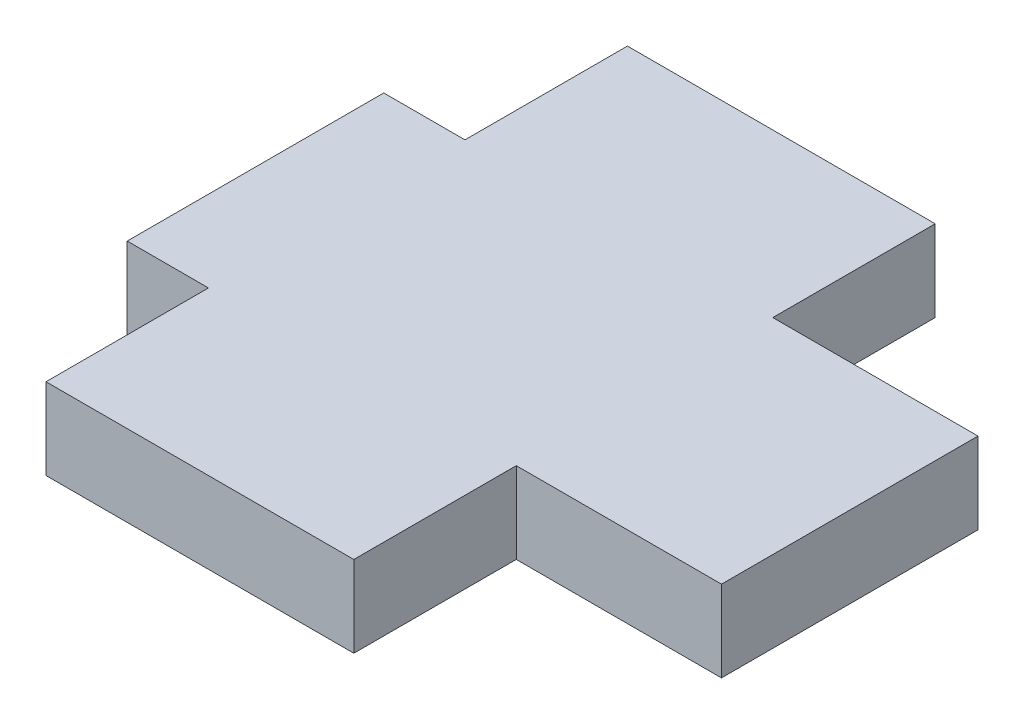
ISO-10303-21;
HEADER;
FILE_DESCRIPTION(('STEP AP214'),'2;1');
FILE_NAME('part.step','',(''),(''),'','','');
FILE_SCHEMA(('AUTOMOTIVE_DESIGN { 1 0 10303 214 1 1 1 1 }'));
ENDSEC;
DATA;
#1=APPLICATION_CONTEXT('core data for automotive mechanical design processes');
#2=APPLICATION_PROTOCOL_DEFINITION('international standard','automotive_design',2000,#1);
#3=PRODUCT_CONTEXT('',#1,'mechanical');
#4=PRODUCT('Part','Part','',(#3));
#5=PRODUCT_RELATED_PRODUCT_CATEGORY('part','',(#4));
#6=PRODUCT_DEFINITION_FORMATION('','',#4);
#7=PRODUCT_DEFINITION_CONTEXT('part definition',#1,'design');
#8=PRODUCT_DEFINITION('design','',#6,#7);
#9=PRODUCT_DEFINITION_SHAPE('','',#8);
#10=(LENGTH_UNIT() NAMED_UNIT(*) SI_UNIT(.MILLI.,.METRE.));
#11=(NAMED_UNIT(*) PLANE_ANGLE_UNIT() SI_UNIT($,.RADIAN.));
#12=(NAMED_UNIT(*) SI_UNIT($,.STERADIAN.) SOLID_ANGLE_UNIT());
#13=UNCERTAINTY_MEASURE_WITH_UNIT(LENGTH_MEASURE(1.E-05),#10,'distance_accuracy_value','');
#14=(GEOMETRIC_REPRESENTATION_CONTEXT(3) GLOBAL_UNCERTAINTY_ASSIGNED_CONTEXT((#13)) GLOBAL_UNIT_ASSIGNED_CONTEXT((#10,
#11,#12)) REPRESENTATION_CONTEXT('',''));
#15=CARTESIAN_POINT('',(0.,0.,0.));
#16=DIRECTION('',(0.,0.,1.));
#17=DIRECTION('',(1.,0.,0.));
#18=AXIS2_PLACEMENT_3D('',#15,#16,#17);
#19=CARTESIAN_POINT('',(0.,6.0325,0.));
#20=DIRECTION('',(1.,0.,0.));
#21=DIRECTION('',(0.,0.,-1.));
#22=AXIS2_PLACEMENT_3D('',#19,#20,#21);
#23=PLANE('',#22);
#24=DIRECTION('',(0.,0.,1.));
#25=VECTOR('',#24,1.);
#26=CARTESIAN_POINT('',(0.,0.,0.));
#27=LINE('',#26,#25);
#28=CARTESIAN_POINT('',(0.,0.,-12.065));
#29=VERTEX_POINT('',#28);
#30=CARTESIAN_POINT('',(0.,0.,0.));
#31=VERTEX_POINT('',#30);
#32=EDGE_CURVE('E166',#29,#31,#27,.T.);
#33=ORIENTED_EDGE('',*,*,#32,.T.);
#34=DIRECTION('',(0.,-1.,0.));
#35=VECTOR('',#34,1.);
#36=CARTESIAN_POINT('',(0.,6.0325,0.));
#37=LINE('',#36,#35);
#38=CARTESIAN_POINT('',(0.,6.0325,0.));
#39=VERTEX_POINT('',#38);
#40=EDGE_CURVE('E11',#39,#31,#37,.T.);
#41=ORIENTED_EDGE('',*,*,#40,.F.);
#42=DIRECTION('',(0.,0.,1.));
#43=VECTOR('',#42,1.);
#44=CARTESIAN_POINT('',(0.,6.0325,0.));
#45=LINE('',#44,#43);
#46=CARTESIAN_POINT('',(0.,6.0325,-12.065));
#47=VERTEX_POINT('',#46);
#48=EDGE_CURVE('E200',#47,#39,#45,.T.);
#49=ORIENTED_EDGE('',*,*,#48,.F.);
#50=DIRECTION('',(0.,-1.,0.));
#51=VECTOR('',#50,1.);
#52=CARTESIAN_POINT('',(0.,6.0325,-12.065));
#53=LINE('',#52,#51);
#54=EDGE_CURVE('E162',#47,#29,#53,.T.);
#55=ORIENTED_EDGE('',*,*,#54,.T.);
#56=EDGE_LOOP('',(#33,#41,#49,#55));
#57=FACE_BOUND('',#56,.T.);
#58=ADVANCED_FACE('F41',(#57),#23,.F.);
#59=CARTESIAN_POINT('',(0.,6.0325,0.));
#60=DIRECTION('',(0.,0.,-1.));
#61=DIRECTION('',(-1.,0.,0.));
#62=AXIS2_PLACEMENT_3D('',#59,#60,#61);
#63=PLANE('',#62);
#64=DIRECTION('',(1.,0.,0.));
#65=VECTOR('',#64,1.);
#66=CARTESIAN_POINT('',(0.,0.,0.));
#67=LINE('',#66,#65);
#68=CARTESIAN_POINT('',(22.86,0.,0.));
#69=VERTEX_POINT('',#68);
#70=EDGE_CURVE('E170',#31,#69,#67,.T.);
#71=ORIENTED_EDGE('',*,*,#70,.T.);
#72=DIRECTION('',(0.,-1.,0.));
#73=VECTOR('',#72,1.);
#74=CARTESIAN_POINT('',(22.86,6.0325,0.));
#75=LINE('',#74,#73);
#76=CARTESIAN_POINT('',(22.86,6.0325,0.));
#77=VERTEX_POINT('',#76);
#78=EDGE_CURVE('E50',#77,#69,#75,.T.);
#79=ORIENTED_EDGE('',*,*,#78,.F.);
#80=DIRECTION('',(1.,0.,0.));
#81=VECTOR('',#80,1.);
#82=CARTESIAN_POINT('',(0.,6.0325,0.));
#83=LINE('',#82,#81);
#84=EDGE_CURVE('E113',#39,#77,#83,.T.);
#85=ORIENTED_EDGE('',*,*,#84,.F.);
#86=ORIENTED_EDGE('',*,*,#40,.T.);
#87=EDGE_LOOP('',(#71,#79,#85,#86));
#88=FACE_BOUND('',#87,.T.);
#89=ADVANCED_FACE('F294',(#88),#63,.F.);
#90=CARTESIAN_POINT('',(22.86,6.0325,0.));
#91=DIRECTION('',(-1.,0.,0.));
#92=DIRECTION('',(0.,0.,1.));
#93=AXIS2_PLACEMENT_3D('',#90,#91,#92);
#94=PLANE('',#93);
#95=DIRECTION('',(0.,0.,-1.));
#96=VECTOR('',#95,1.);
#97=CARTESIAN_POINT('',(22.86,0.,0.));
#98=LINE('',#97,#96);
#99=CARTESIAN_POINT('',(22.86,0.,-12.065));
#100=VERTEX_POINT('',#99);
#101=EDGE_CURVE('E173',#69,#100,#98,.T.);
#102=ORIENTED_EDGE('',*,*,#101,.T.);
#103=DIRECTION('',(0.,-1.,0.));
#104=VECTOR('',#103,1.);
#105=CARTESIAN_POINT('',(22.86,6.0325,-12.065));
#106=LINE('',#105,#104);
#107=CARTESIAN_POINT('',(22.86,6.0325,-12.065));
#108=VERTEX_POINT('',#107);
#109=EDGE_CURVE('E227',#108,#100,#106,.T.);
#110=ORIENTED_EDGE('',*,*,#109,.F.);
#111=DIRECTION('',(0.,0.,-1.));
#112=VECTOR('',#111,1.);
#113=CARTESIAN_POINT('',(22.86,6.0325,0.));
#114=LINE('',#113,#112);
#115=EDGE_CURVE('E237',#77,#108,#114,.T.);
#116=ORIENTED_EDGE('',*,*,#115,.F.);
#117=ORIENTED_EDGE('',*,*,#78,.T.);
#118=EDGE_LOOP('',(#102,#110,#116,#117));
#119=FACE_BOUND('',#118,.T.);
#120=ADVANCED_FACE('F235',(#119),#94,.F.);
#121=CARTESIAN_POINT('',(22.86,6.0325,-12.065));
#122=DIRECTION('',(0.,0.,-1.));
#123=DIRECTION('',(-1.,0.,0.));
#124=AXIS2_PLACEMENT_3D('',#121,#122,#123);
#125=PLANE('',#124);
#126=DIRECTION('',(1.,0.,0.));
#127=VECTOR('',#126,1.);
#128=CARTESIAN_POINT('',(22.86,0.,-12.065));
#129=LINE('',#128,#127);
#130=CARTESIAN_POINT('',(38.1,0.,-12.065));
#131=VERTEX_POINT('',#130);
#132=EDGE_CURVE('E176',#100,#131,#129,.T.);
#133=ORIENTED_EDGE('',*,*,#132,.T.);
#134=DIRECTION('',(0.,-1.,0.));
#135=VECTOR('',#134,1.);
#136=CARTESIAN_POINT('',(38.1,6.0325,-12.065));
#137=LINE('',#136,#135);
#138=CARTESIAN_POINT('',(38.1,6.0325,-12.065));
#139=VERTEX_POINT('',#138);
#140=EDGE_CURVE('E223',#139,#131,#137,.T.);
#141=ORIENTED_EDGE('',*,*,#140,.F.);
#142=DIRECTION('',(1.,0.,0.));
#143=VECTOR('',#142,1.);
#144=CARTESIAN_POINT('',(22.86,6.0325,-12.065));
#145=LINE('',#144,#143);
#146=EDGE_CURVE('E256',#108,#139,#145,.T.);
#147=ORIENTED_EDGE('',*,*,#146,.F.);
#148=ORIENTED_EDGE('',*,*,#109,.T.);
#149=EDGE_LOOP('',(#133,#141,#147,#148));
#150=FACE_BOUND('',#149,.T.);
#151=ADVANCED_FACE('F246',(#150),#125,.F.);
#152=CARTESIAN_POINT('',(38.1,6.0325,-12.065));
#153=DIRECTION('',(-1.,0.,0.));
#154=DIRECTION('',(0.,0.,1.));
#155=AXIS2_PLACEMENT_3D('',#152,#153,#154);
#156=PLANE('',#155);
#157=DIRECTION('',(0.,0.,-1.));
#158=VECTOR('',#157,1.);
#159=CARTESIAN_POINT('',(38.1,0.,-12.065));
#160=LINE('',#159,#158);
#161=CARTESIAN_POINT('',(38.1,0.,-31.115));
#162=VERTEX_POINT('',#161);
#163=EDGE_CURVE('E179',#131,#162,#160,.T.);
#164=ORIENTED_EDGE('',*,*,#163,.T.);
#165=DIRECTION('',(0.,-1.,0.));
#166=VECTOR('',#165,1.);
#167=CARTESIAN_POINT('',(38.1,6.0325,-31.115));
#168=LINE('',#167,#166);
#169=CARTESIAN_POINT('',(38.1,6.0325,-31.115));
#170=VERTEX_POINT('',#169);
#171=EDGE_CURVE('E219',#170,#162,#168,.T.);
#172=ORIENTED_EDGE('',*,*,#171,.F.);
#173=DIRECTION('',(0.,0.,-1.));
#174=VECTOR('',#173,1.);
#175=CARTESIAN_POINT('',(38.1,6.0325,-12.065));
#176=LINE('',#175,#174);
#177=EDGE_CURVE('E252',#139,#170,#176,.T.);
#178=ORIENTED_EDGE('',*,*,#177,.F.);
#179=ORIENTED_EDGE('',*,*,#140,.T.);
#180=EDGE_LOOP('',(#164,#172,#178,#179));
#181=FACE_BOUND('',#180,.T.);
#182=ADVANCED_FACE('F250',(#181),#156,.F.);
#183=CARTESIAN_POINT('',(22.86,6.0325,-31.115));
#184=DIRECTION('',(0.,0.,1.));
#185=DIRECTION('',(1.,0.,0.));
#186=AXIS2_PLACEMENT_3D('',#183,#184,#185);
#187=PLANE('',#186);
#188=DIRECTION('',(-1.,0.,0.));
#189=VECTOR('',#188,1.);
#190=CARTESIAN_POINT('',(22.86,0.,-31.115));
#191=LINE('',#190,#189);
#192=CARTESIAN_POINT('',(22.86,0.,-31.115));
#193=VERTEX_POINT('',#192);
#194=EDGE_CURVE('E182',#162,#193,#191,.T.);
#195=ORIENTED_EDGE('',*,*,#194,.T.);
#196=DIRECTION('',(0.,-1.,0.));
#197=VECTOR('',#196,1.);
#198=CARTESIAN_POINT('',(22.86,6.0325,-31.115));
#199=LINE('',#198,#197);
#200=CARTESIAN_POINT('',(22.86,6.0325,-31.115));
#201=VERTEX_POINT('',#200);
#202=EDGE_CURVE('E215',#201,#193,#199,.T.);
#203=ORIENTED_EDGE('',*,*,#202,.F.);
#204=DIRECTION('',(-1.,0.,0.));
#205=VECTOR('',#204,1.);
#206=CARTESIAN_POINT('',(22.86,6.0325,-31.115));
#207=LINE('',#206,#205);
#208=EDGE_CURVE('E255',#170,#201,#207,.T.);
#209=ORIENTED_EDGE('',*,*,#208,.F.);
#210=ORIENTED_EDGE('',*,*,#171,.T.);
#211=EDGE_LOOP('',(#195,#203,#209,#210));
#212=FACE_BOUND('',#211,.T.);
#213=ADVANCED_FACE('F307',(#212),#187,.F.);
#214=CARTESIAN_POINT('',(22.86,6.0325,-31.115));
#215=DIRECTION('',(-1.,0.,0.));
#216=DIRECTION('',(0.,0.,1.));
#217=AXIS2_PLACEMENT_3D('',#214,#215,#216);
#218=PLANE('',#217);
#219=DIRECTION('',(0.,0.,-1.));
#220=VECTOR('',#219,1.);
#221=CARTESIAN_POINT('',(22.86,0.,-31.115));
#222=LINE('',#221,#220);
#223=CARTESIAN_POINT('',(22.86,0.,-43.18));
#224=VERTEX_POINT('',#223);
#225=EDGE_CURVE('E185',#193,#224,#222,.T.);
#226=ORIENTED_EDGE('',*,*,#225,.T.);
#227=DIRECTION('',(0.,-1.,0.));
#228=VECTOR('',#227,1.);
#229=CARTESIAN_POINT('',(22.86,6.0325,-43.18));
#230=LINE('',#229,#228);
#231=CARTESIAN_POINT('',(22.86,6.0325,-43.18));
#232=VERTEX_POINT('',#231);
#233=EDGE_CURVE('E211',#232,#224,#230,.T.);
#234=ORIENTED_EDGE('',*,*,#233,.F.);
#235=DIRECTION('',(0.,0.,-1.));
#236=VECTOR('',#235,1.);
#237=CARTESIAN_POINT('',(22.86,6.0325,-31.115));
#238=LINE('',#237,#236);
#239=EDGE_CURVE('E260',#201,#232,#238,.T.);
#240=ORIENTED_EDGE('',*,*,#239,.F.);
#241=ORIENTED_EDGE('',*,*,#202,.T.);
#242=EDGE_LOOP('',(#226,#234,#240,#241));
#243=FACE_BOUND('',#242,.T.);
#244=ADVANCED_FACE('F310',(#243),#218,.F.);
#245=CARTESIAN_POINT('',(0.,6.0325,-43.18));
#246=DIRECTION('',(0.,0.,1.));
#247=DIRECTION('',(1.,0.,0.));
#248=AXIS2_PLACEMENT_3D('',#245,#246,#247);
#249=PLANE('',#248);
#250=DIRECTION('',(-1.,0.,0.));
#251=VECTOR('',#250,1.);
#252=CARTESIAN_POINT('',(0.,0.,-43.18));
#253=LINE('',#252,#251);
#254=CARTESIAN_POINT('',(0.,0.,-43.18));
#255=VERTEX_POINT('',#254);
#256=EDGE_CURVE('E188',#224,#255,#253,.T.);
#257=ORIENTED_EDGE('',*,*,#256,.T.);
#258=DIRECTION('',(0.,-1.,0.));
#259=VECTOR('',#258,1.);
#260=CARTESIAN_POINT('',(0.,6.0325,-43.18));
#261=LINE('',#260,#259);
#262=CARTESIAN_POINT('',(0.,6.0325,-43.18));
#263=VERTEX_POINT('',#262);
#264=EDGE_CURVE('E207',#263,#255,#261,.T.);
#265=ORIENTED_EDGE('',*,*,#264,.F.);
#266=DIRECTION('',(-1.,0.,0.));
#267=VECTOR('',#266,1.);
#268=CARTESIAN_POINT('',(0.,6.0325,-43.18));
#269=LINE('',#268,#267);
#270=EDGE_CURVE('E267',#232,#263,#269,.T.);
#271=ORIENTED_EDGE('',*,*,#270,.F.);
#272=ORIENTED_EDGE('',*,*,#233,.T.);
#273=EDGE_LOOP('',(#257,#265,#271,#272));
#274=FACE_BOUND('',#273,.T.);
#275=ADVANCED_FACE('F275',(#274),#249,.F.);
#276=CARTESIAN_POINT('',(0.,6.0325,-31.115));
#277=DIRECTION('',(1.,0.,0.));
#278=DIRECTION('',(0.,0.,-1.));
#279=AXIS2_PLACEMENT_3D('',#276,#277,#278);
#280=PLANE('',#279);
#281=DIRECTION('',(0.,0.,1.));
#282=VECTOR('',#281,1.);
#283=CARTESIAN_POINT('',(0.,0.,-31.115));
#284=LINE('',#283,#282);
#285=CARTESIAN_POINT('',(0.,0.,-31.115));
#286=VERTEX_POINT('',#285);
#287=EDGE_CURVE('E191',#255,#286,#284,.T.);
#288=ORIENTED_EDGE('',*,*,#287,.T.);
#289=DIRECTION('',(0.,-1.,0.));
#290=VECTOR('',#289,1.);
#291=CARTESIAN_POINT('',(0.,6.0325,-31.115));
#292=LINE('',#291,#290);
#293=CARTESIAN_POINT('',(0.,6.0325,-31.115));
#294=VERTEX_POINT('',#293);
#295=EDGE_CURVE('E155',#294,#286,#292,.T.);
#296=ORIENTED_EDGE('',*,*,#295,.F.);
#297=DIRECTION('',(0.,0.,1.));
#298=VECTOR('',#297,1.);
#299=CARTESIAN_POINT('',(0.,6.0325,-31.115));
#300=LINE('',#299,#298);
#301=EDGE_CURVE('E144',#263,#294,#300,.T.);
#302=ORIENTED_EDGE('',*,*,#301,.F.);
#303=ORIENTED_EDGE('',*,*,#264,.T.);
#304=EDGE_LOOP('',(#288,#296,#302,#303));
#305=FACE_BOUND('',#304,.T.);
#306=ADVANCED_FACE('F279',(#305),#280,.F.);
#307=CARTESIAN_POINT('',(0.,6.0325,-31.115));
#308=DIRECTION('',(0.,0.,1.));
#309=DIRECTION('',(1.,0.,0.));
#310=AXIS2_PLACEMENT_3D('',#307,#308,#309);
#311=PLANE('',#310);
#312=DIRECTION('',(-1.,0.,0.));
#313=VECTOR('',#312,1.);
#314=CARTESIAN_POINT('',(0.,0.,-31.115));
#315=LINE('',#314,#313);
#316=CARTESIAN_POINT('',(-6.0325,0.,-31.115));
#317=VERTEX_POINT('',#316);
#318=EDGE_CURVE('E153',#286,#317,#315,.T.);
#319=ORIENTED_EDGE('',*,*,#318,.T.);
#320=DIRECTION('',(0.,-1.,0.));
#321=VECTOR('',#320,1.);
#322=CARTESIAN_POINT('',(-6.0325,6.0325,-31.115));
#323=LINE('',#322,#321);
#324=CARTESIAN_POINT('',(-6.0325,6.0325,-31.115));
#325=VERTEX_POINT('',#324);
#326=EDGE_CURVE('E150',#325,#317,#323,.T.);
#327=ORIENTED_EDGE('',*,*,#326,.F.);
#328=DIRECTION('',(-1.,0.,0.));
#329=VECTOR('',#328,1.);
#330=CARTESIAN_POINT('',(0.,6.0325,-31.115));
#331=LINE('',#330,#329);
#332=EDGE_CURVE('E138',#294,#325,#331,.T.);
#333=ORIENTED_EDGE('',*,*,#332,.F.);
#334=ORIENTED_EDGE('',*,*,#295,.T.);
#335=EDGE_LOOP('',(#319,#327,#333,#334));
#336=FACE_BOUND('',#335,.T.);
#337=ADVANCED_FACE('F151',(#336),#311,.F.);
#338=CARTESIAN_POINT('',(-6.0325,6.0325,-12.065));
#339=DIRECTION('',(1.,0.,0.));
#340=DIRECTION('',(0.,0.,-1.));
#341=AXIS2_PLACEMENT_3D('',#338,#339,#340);
#342=PLANE('',#341);
#343=DIRECTION('',(0.,0.,1.));
#344=VECTOR('',#343,1.);
#345=CARTESIAN_POINT('',(-6.0325,0.,-12.065));
#346=LINE('',#345,#344);
#347=CARTESIAN_POINT('',(-6.0325,0.,-12.065));
#348=VERTEX_POINT('',#347);
#349=EDGE_CURVE('E99',#317,#348,#346,.T.);
#350=ORIENTED_EDGE('',*,*,#349,.T.);
#351=DIRECTION('',(0.,-1.,0.));
#352=VECTOR('',#351,1.);
#353=CARTESIAN_POINT('',(-6.0325,6.0325,-12.065));
#354=LINE('',#353,#352);
#355=CARTESIAN_POINT('',(-6.0325,6.0325,-12.065));
#356=VERTEX_POINT('',#355);
#357=EDGE_CURVE('E156',#356,#348,#354,.T.);
#358=ORIENTED_EDGE('',*,*,#357,.F.);
#359=DIRECTION('',(0.,0.,1.));
#360=VECTOR('',#359,1.);
#361=CARTESIAN_POINT('',(-6.0325,6.0325,-12.065));
#362=LINE('',#361,#360);
#363=EDGE_CURVE('E142',#325,#356,#362,.T.);
#364=ORIENTED_EDGE('',*,*,#363,.F.);
#365=ORIENTED_EDGE('',*,*,#326,.T.);
#366=EDGE_LOOP('',(#350,#358,#364,#365));
#367=FACE_BOUND('',#366,.T.);
#368=ADVANCED_FACE('F158',(#367),#342,.F.);
#369=CARTESIAN_POINT('',(0.,6.0325,-12.065));
#370=DIRECTION('',(0.,0.,-1.));
#371=DIRECTION('',(-1.,0.,0.));
#372=AXIS2_PLACEMENT_3D('',#369,#370,#371);
#373=PLANE('',#372);
#374=DIRECTION('',(1.,0.,0.));
#375=VECTOR('',#374,1.);
#376=CARTESIAN_POINT('',(0.,0.,-12.065));
#377=LINE('',#376,#375);
#378=EDGE_CURVE('E105',#348,#29,#377,.T.);
#379=ORIENTED_EDGE('',*,*,#378,.T.);
#380=ORIENTED_EDGE('',*,*,#54,.F.);
#381=DIRECTION('',(1.,0.,0.));
#382=VECTOR('',#381,1.);
#383=CARTESIAN_POINT('',(0.,6.0325,-12.065));
#384=LINE('',#383,#382);
#385=EDGE_CURVE('E58',#356,#47,#384,.T.);
#386=ORIENTED_EDGE('',*,*,#385,.F.);
#387=ORIENTED_EDGE('',*,*,#357,.T.);
#388=EDGE_LOOP('',(#379,#380,#386,#387));
#389=FACE_BOUND('',#388,.T.);
#390=ADVANCED_FACE('F283',(#389),#373,.F.);
#391=CARTESIAN_POINT('',(0.,6.0325,0.));
#392=DIRECTION('',(0.,1.,0.));
#393=DIRECTION('',(0.,0.,1.));
#394=AXIS2_PLACEMENT_3D('',#391,#392,#393);
#395=PLANE('',#394);
#396=ORIENTED_EDGE('',*,*,#48,.T.);
#397=ORIENTED_EDGE('',*,*,#84,.T.);
#398=ORIENTED_EDGE('',*,*,#115,.T.);
#399=ORIENTED_EDGE('',*,*,#146,.T.);
#400=ORIENTED_EDGE('',*,*,#177,.T.);
#401=ORIENTED_EDGE('',*,*,#208,.T.);
#402=ORIENTED_EDGE('',*,*,#239,.T.);
#403=ORIENTED_EDGE('',*,*,#270,.T.);
#404=ORIENTED_EDGE('',*,*,#301,.T.);
#405=ORIENTED_EDGE('',*,*,#332,.T.);
#406=ORIENTED_EDGE('',*,*,#363,.T.);
#407=ORIENTED_EDGE('',*,*,#385,.T.);
#408=EDGE_LOOP('',(#396,#397,#398,#399,#400,#401,#402,#403,#404,#405,#406,#407));
#409=FACE_BOUND('',#408,.T.);
#410=ADVANCED_FACE('F140',(#409),#395,.T.);
#411=CARTESIAN_POINT('',(0.,0.,0.));
#412=DIRECTION('',(0.,1.,0.));
#413=DIRECTION('',(0.,0.,1.));
#414=AXIS2_PLACEMENT_3D('',#411,#412,#413);
#415=PLANE('',#414);
#416=ORIENTED_EDGE('',*,*,#32,.F.);
#417=ORIENTED_EDGE('',*,*,#378,.F.);
#418=ORIENTED_EDGE('',*,*,#349,.F.);
#419=ORIENTED_EDGE('',*,*,#318,.F.);
#420=ORIENTED_EDGE('',*,*,#287,.F.);
#421=ORIENTED_EDGE('',*,*,#256,.F.);
#422=ORIENTED_EDGE('',*,*,#225,.F.);
#423=ORIENTED_EDGE('',*,*,#194,.F.);
#424=ORIENTED_EDGE('',*,*,#163,.F.);
#425=ORIENTED_EDGE('',*,*,#132,.F.);
#426=ORIENTED_EDGE('',*,*,#101,.F.);
#427=ORIENTED_EDGE('',*,*,#70,.F.);
#428=EDGE_LOOP('',(#416,#417,#418,#419,#420,#421,#422,#423,#424,#425,#426,#427));
#429=FACE_BOUND('',#428,.T.);
#430=ADVANCED_FACE('F241',(#429),#415,.F.);
#431=CLOSED_SHELL('',(#58,#89,#120,#151,#182,#213,#244,#275,#306,#337,#368,#390,#410,#430));
#432=MANIFOLD_SOLID_BREP('B2',#431);
#433=ADVANCED_BREP_SHAPE_REPRESENTATION('',(#18,#432),#14);
#434=SHAPE_DEFINITION_REPRESENTATION(#9,#433);
ENDSEC;
END-ISO-10303-21;
